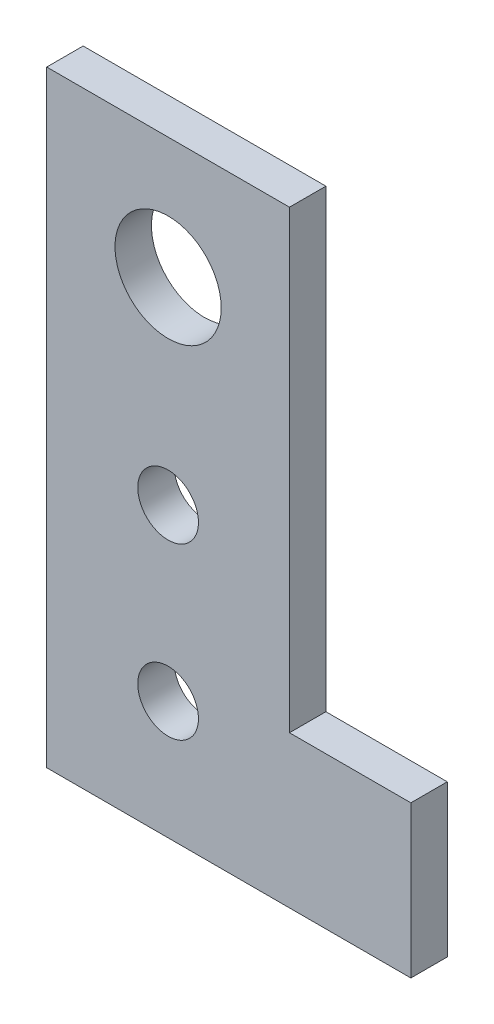
ISO-10303-21;
HEADER;
FILE_DESCRIPTION(('STEP AP214'),'2;1');
FILE_NAME('part.step','',(''),(''),'','','');
FILE_SCHEMA(('AUTOMOTIVE_DESIGN { 1 0 10303 214 1 1 1 1 }'));
ENDSEC;
DATA;
#1=APPLICATION_CONTEXT('core data for automotive mechanical design processes');
#2=APPLICATION_PROTOCOL_DEFINITION('international standard','automotive_design',2000,#1);
#3=PRODUCT_CONTEXT('',#1,'mechanical');
#4=PRODUCT('Part','Part','',(#3));
#5=PRODUCT_RELATED_PRODUCT_CATEGORY('part','',(#4));
#6=PRODUCT_DEFINITION_FORMATION('','',#4);
#7=PRODUCT_DEFINITION_CONTEXT('part definition',#1,'design');
#8=PRODUCT_DEFINITION('design','',#6,#7);
#9=PRODUCT_DEFINITION_SHAPE('','',#8);
#10=(LENGTH_UNIT() NAMED_UNIT(*) SI_UNIT(.MILLI.,.METRE.));
#11=(NAMED_UNIT(*) PLANE_ANGLE_UNIT() SI_UNIT($,.RADIAN.));
#12=(NAMED_UNIT(*) SI_UNIT($,.STERADIAN.) SOLID_ANGLE_UNIT());
#13=UNCERTAINTY_MEASURE_WITH_UNIT(LENGTH_MEASURE(1.E-05),#10,'distance_accuracy_value','');
#14=(GEOMETRIC_REPRESENTATION_CONTEXT(3) GLOBAL_UNCERTAINTY_ASSIGNED_CONTEXT((#13)) GLOBAL_UNIT_ASSIGNED_CONTEXT((#10,
#11,#12)) REPRESENTATION_CONTEXT('',''));
#15=CARTESIAN_POINT('',(0.,0.,0.));
#16=DIRECTION('',(0.,0.,1.));
#17=DIRECTION('',(1.,0.,0.));
#18=AXIS2_PLACEMENT_3D('',#15,#16,#17);
#19=CARTESIAN_POINT('',(0.,0.,-1.2));
#20=DIRECTION('',(-1.,0.,0.));
#21=DIRECTION('',(0.,-1.,0.));
#22=AXIS2_PLACEMENT_3D('',#19,#20,#21);
#23=PLANE('',#22);
#24=DIRECTION('',(0.,-1.,0.));
#25=VECTOR('',#24,1.);
#26=CARTESIAN_POINT('',(0.,0.,0.));
#27=LINE('',#26,#25);
#28=CARTESIAN_POINT('',(0.,20.,0.));
#29=VERTEX_POINT('',#28);
#30=CARTESIAN_POINT('',(0.,0.,0.));
#31=VERTEX_POINT('',#30);
#32=EDGE_CURVE('E123',#29,#31,#27,.T.);
#33=ORIENTED_EDGE('',*,*,#32,.F.);
#34=DIRECTION('',(0.,0.,1.));
#35=VECTOR('',#34,1.);
#36=CARTESIAN_POINT('',(0.,20.,-1.2));
#37=LINE('',#36,#35);
#38=CARTESIAN_POINT('',(0.,20.,-1.2));
#39=VERTEX_POINT('',#38);
#40=EDGE_CURVE('E11',#39,#29,#37,.T.);
#41=ORIENTED_EDGE('',*,*,#40,.F.);
#42=DIRECTION('',(0.,-1.,0.));
#43=VECTOR('',#42,1.);
#44=CARTESIAN_POINT('',(0.,0.,-1.2));
#45=LINE('',#44,#43);
#46=CARTESIAN_POINT('',(0.,0.,-1.2));
#47=VERTEX_POINT('',#46);
#48=EDGE_CURVE('E138',#39,#47,#45,.T.);
#49=ORIENTED_EDGE('',*,*,#48,.T.);
#50=DIRECTION('',(0.,0.,1.));
#51=VECTOR('',#50,1.);
#52=CARTESIAN_POINT('',(0.,0.,-1.2));
#53=LINE('',#52,#51);
#54=EDGE_CURVE('E41',#47,#31,#53,.T.);
#55=ORIENTED_EDGE('',*,*,#54,.T.);
#56=EDGE_LOOP('',(#33,#41,#49,#55));
#57=FACE_BOUND('',#56,.T.);
#58=ADVANCED_FACE('F38',(#57),#23,.T.);
#59=CARTESIAN_POINT('',(0.,20.,-1.2));
#60=DIRECTION('',(0.,1.,0.));
#61=DIRECTION('',(-1.,0.,0.));
#62=AXIS2_PLACEMENT_3D('',#59,#60,#61);
#63=PLANE('',#62);
#64=DIRECTION('',(-1.,0.,0.));
#65=VECTOR('',#64,1.);
#66=CARTESIAN_POINT('',(0.,20.,0.));
#67=LINE('',#66,#65);
#68=CARTESIAN_POINT('',(8.00000000000001,20.,0.));
#69=VERTEX_POINT('',#68);
#70=EDGE_CURVE('E136',#69,#29,#67,.T.);
#71=ORIENTED_EDGE('',*,*,#70,.F.);
#72=DIRECTION('',(0.,0.,1.));
#73=VECTOR('',#72,1.);
#74=CARTESIAN_POINT('',(8.00000000000001,20.,-1.2));
#75=LINE('',#74,#73);
#76=CARTESIAN_POINT('',(8.00000000000001,20.,-1.2));
#77=VERTEX_POINT('',#76);
#78=EDGE_CURVE('E47',#77,#69,#75,.T.);
#79=ORIENTED_EDGE('',*,*,#78,.F.);
#80=DIRECTION('',(-1.,0.,0.));
#81=VECTOR('',#80,1.);
#82=CARTESIAN_POINT('',(0.,20.,-1.2));
#83=LINE('',#82,#81);
#84=EDGE_CURVE('E113',#77,#39,#83,.T.);
#85=ORIENTED_EDGE('',*,*,#84,.T.);
#86=ORIENTED_EDGE('',*,*,#40,.T.);
#87=EDGE_LOOP('',(#71,#79,#85,#86));
#88=FACE_BOUND('',#87,.T.);
#89=ADVANCED_FACE('F146',(#88),#63,.T.);
#90=CARTESIAN_POINT('',(8.00000000000002,5.,-1.2));
#91=DIRECTION('',(1.,0.,0.));
#92=DIRECTION('',(0.,1.,0.));
#93=AXIS2_PLACEMENT_3D('',#90,#91,#92);
#94=PLANE('',#93);
#95=DIRECTION('',(0.,1.,0.));
#96=VECTOR('',#95,1.);
#97=CARTESIAN_POINT('',(8.00000000000002,5.,0.));
#98=LINE('',#97,#96);
#99=CARTESIAN_POINT('',(8.00000000000002,5.,0.));
#100=VERTEX_POINT('',#99);
#101=EDGE_CURVE('E100',#100,#69,#98,.T.);
#102=ORIENTED_EDGE('',*,*,#101,.F.);
#103=DIRECTION('',(0.,0.,1.));
#104=VECTOR('',#103,1.);
#105=CARTESIAN_POINT('',(8.00000000000002,5.,-1.2));
#106=LINE('',#105,#104);
#107=CARTESIAN_POINT('',(8.00000000000002,5.,-1.2));
#108=VERTEX_POINT('',#107);
#109=EDGE_CURVE('E95',#108,#100,#106,.T.);
#110=ORIENTED_EDGE('',*,*,#109,.F.);
#111=DIRECTION('',(0.,1.,0.));
#112=VECTOR('',#111,1.);
#113=CARTESIAN_POINT('',(8.00000000000002,5.,-1.2));
#114=LINE('',#113,#112);
#115=EDGE_CURVE('E98',#108,#77,#114,.T.);
#116=ORIENTED_EDGE('',*,*,#115,.T.);
#117=ORIENTED_EDGE('',*,*,#78,.T.);
#118=EDGE_LOOP('',(#102,#110,#116,#117));
#119=FACE_BOUND('',#118,.T.);
#120=ADVANCED_FACE('F97',(#119),#94,.T.);
#121=CARTESIAN_POINT('',(8.00000000000002,5.,-1.2));
#122=DIRECTION('',(0.,1.,0.));
#123=DIRECTION('',(0.,0.,1.));
#124=AXIS2_PLACEMENT_3D('',#121,#122,#123);
#125=PLANE('',#124);
#126=DIRECTION('',(-1.,0.,0.));
#127=VECTOR('',#126,1.);
#128=CARTESIAN_POINT('',(8.00000000000002,5.,0.));
#129=LINE('',#128,#127);
#130=CARTESIAN_POINT('',(12.,5.,0.));
#131=VERTEX_POINT('',#130);
#132=EDGE_CURVE('E133',#131,#100,#129,.T.);
#133=ORIENTED_EDGE('',*,*,#132,.F.);
#134=DIRECTION('',(0.,0.,1.));
#135=VECTOR('',#134,1.);
#136=CARTESIAN_POINT('',(12.,5.,-1.2));
#137=LINE('',#136,#135);
#138=CARTESIAN_POINT('',(12.,5.,-1.2));
#139=VERTEX_POINT('',#138);
#140=EDGE_CURVE('E105',#139,#131,#137,.T.);
#141=ORIENTED_EDGE('',*,*,#140,.F.);
#142=DIRECTION('',(-1.,0.,0.));
#143=VECTOR('',#142,1.);
#144=CARTESIAN_POINT('',(8.00000000000002,5.,-1.2));
#145=LINE('',#144,#143);
#146=EDGE_CURVE('E111',#139,#108,#145,.T.);
#147=ORIENTED_EDGE('',*,*,#146,.T.);
#148=ORIENTED_EDGE('',*,*,#109,.T.);
#149=EDGE_LOOP('',(#133,#141,#147,#148));
#150=FACE_BOUND('',#149,.T.);
#151=ADVANCED_FACE('F115',(#150),#125,.T.);
#152=CARTESIAN_POINT('',(12.,0.,-1.2));
#153=DIRECTION('',(1.,0.,0.));
#154=DIRECTION('',(0.,0.,-1.));
#155=AXIS2_PLACEMENT_3D('',#152,#153,#154);
#156=PLANE('',#155);
#157=DIRECTION('',(0.,1.,0.));
#158=VECTOR('',#157,1.);
#159=CARTESIAN_POINT('',(12.,0.,0.));
#160=LINE('',#159,#158);
#161=CARTESIAN_POINT('',(12.,0.,0.));
#162=VERTEX_POINT('',#161);
#163=EDGE_CURVE('E130',#162,#131,#160,.T.);
#164=ORIENTED_EDGE('',*,*,#163,.F.);
#165=DIRECTION('',(0.,0.,1.));
#166=VECTOR('',#165,1.);
#167=CARTESIAN_POINT('',(12.,0.,-1.2));
#168=LINE('',#167,#166);
#169=CARTESIAN_POINT('',(12.,0.,-1.2));
#170=VERTEX_POINT('',#169);
#171=EDGE_CURVE('E141',#170,#162,#168,.T.);
#172=ORIENTED_EDGE('',*,*,#171,.F.);
#173=DIRECTION('',(0.,1.,0.));
#174=VECTOR('',#173,1.);
#175=CARTESIAN_POINT('',(12.,0.,-1.2));
#176=LINE('',#175,#174);
#177=EDGE_CURVE('E116',#170,#139,#176,.T.);
#178=ORIENTED_EDGE('',*,*,#177,.T.);
#179=ORIENTED_EDGE('',*,*,#140,.T.);
#180=EDGE_LOOP('',(#164,#172,#178,#179));
#181=FACE_BOUND('',#180,.T.);
#182=ADVANCED_FACE('F159',(#181),#156,.T.);
#183=CARTESIAN_POINT('',(0.,0.,-1.2));
#184=DIRECTION('',(0.,-1.,0.));
#185=DIRECTION('',(0.,0.,-1.));
#186=AXIS2_PLACEMENT_3D('',#183,#184,#185);
#187=PLANE('',#186);
#188=DIRECTION('',(1.,0.,0.));
#189=VECTOR('',#188,1.);
#190=CARTESIAN_POINT('',(0.,0.,0.));
#191=LINE('',#190,#189);
#192=EDGE_CURVE('E126',#31,#162,#191,.T.);
#193=ORIENTED_EDGE('',*,*,#192,.F.);
#194=ORIENTED_EDGE('',*,*,#54,.F.);
#195=DIRECTION('',(1.,0.,0.));
#196=VECTOR('',#195,1.);
#197=CARTESIAN_POINT('',(0.,0.,-1.2));
#198=LINE('',#197,#196);
#199=EDGE_CURVE('E118',#47,#170,#198,.T.);
#200=ORIENTED_EDGE('',*,*,#199,.T.);
#201=ORIENTED_EDGE('',*,*,#171,.T.);
#202=EDGE_LOOP('',(#193,#194,#200,#201));
#203=FACE_BOUND('',#202,.T.);
#204=ADVANCED_FACE('F143',(#203),#187,.T.);
#205=CARTESIAN_POINT('',(0.,0.,-1.2));
#206=DIRECTION('',(0.,0.,-1.));
#207=DIRECTION('',(-1.,0.,0.));
#208=AXIS2_PLACEMENT_3D('',#205,#206,#207);
#209=PLANE('',#208);
#210=CARTESIAN_POINT('',(4.00000000000001,3.9,-1.2));
#211=DIRECTION('',(0.,0.,1.));
#212=DIRECTION('',(1.,0.,0.));
#213=AXIS2_PLACEMENT_3D('',#210,#211,#212);
#214=CIRCLE('',#213,1.);
#215=CARTESIAN_POINT('',(5.00000000000001,3.9,-1.2));
#216=VERTEX_POINT('',#215);
#217=EDGE_CURVE('E189',#216,#216,#214,.T.);
#218=ORIENTED_EDGE('',*,*,#217,.T.);
#219=EDGE_LOOP('',(#218));
#220=FACE_BOUND('',#219,.T.);
#221=CARTESIAN_POINT('',(4.00000000000001,9.5,-1.2));
#222=DIRECTION('',(0.,0.,1.));
#223=DIRECTION('',(1.,0.,0.));
#224=AXIS2_PLACEMENT_3D('',#221,#222,#223);
#225=CIRCLE('',#224,1.);
#226=CARTESIAN_POINT('',(5.00000000000001,9.5,-1.2));
#227=VERTEX_POINT('',#226);
#228=EDGE_CURVE('E197',#227,#227,#225,.T.);
#229=ORIENTED_EDGE('',*,*,#228,.T.);
#230=EDGE_LOOP('',(#229));
#231=FACE_BOUND('',#230,.T.);
#232=CARTESIAN_POINT('',(4.00000000000001,16.,-1.2));
#233=DIRECTION('',(0.,0.,1.));
#234=DIRECTION('',(1.,0.,0.));
#235=AXIS2_PLACEMENT_3D('',#232,#233,#234);
#236=CIRCLE('',#235,1.75);
#237=CARTESIAN_POINT('',(5.75000000000001,16.,-1.2));
#238=VERTEX_POINT('',#237);
#239=EDGE_CURVE('E127',#238,#238,#236,.T.);
#240=ORIENTED_EDGE('',*,*,#239,.T.);
#241=EDGE_LOOP('',(#240));
#242=FACE_BOUND('',#241,.T.);
#243=ORIENTED_EDGE('',*,*,#48,.F.);
#244=ORIENTED_EDGE('',*,*,#84,.F.);
#245=ORIENTED_EDGE('',*,*,#115,.F.);
#246=ORIENTED_EDGE('',*,*,#146,.F.);
#247=ORIENTED_EDGE('',*,*,#177,.F.);
#248=ORIENTED_EDGE('',*,*,#199,.F.);
#249=EDGE_LOOP('',(#243,#244,#245,#246,#247,#248));
#250=FACE_BOUND('',#249,.T.);
#251=ADVANCED_FACE('F109',(#220,#231,#242,#250),#209,.T.);
#252=CARTESIAN_POINT('',(0.,0.,0.));
#253=DIRECTION('',(0.,0.,-1.));
#254=DIRECTION('',(-1.,0.,0.));
#255=AXIS2_PLACEMENT_3D('',#252,#253,#254);
#256=PLANE('',#255);
#257=CARTESIAN_POINT('',(4.00000000000001,3.9,0.));
#258=DIRECTION('',(0.,0.,1.));
#259=DIRECTION('',(1.,0.,0.));
#260=AXIS2_PLACEMENT_3D('',#257,#258,#259);
#261=CIRCLE('',#260,1.);
#262=CARTESIAN_POINT('',(5.00000000000001,3.9,0.));
#263=VERTEX_POINT('',#262);
#264=EDGE_CURVE('E192',#263,#263,#261,.T.);
#265=ORIENTED_EDGE('',*,*,#264,.F.);
#266=EDGE_LOOP('',(#265));
#267=FACE_BOUND('',#266,.T.);
#268=CARTESIAN_POINT('',(4.00000000000001,9.5,0.));
#269=DIRECTION('',(0.,0.,1.));
#270=DIRECTION('',(1.,0.,0.));
#271=AXIS2_PLACEMENT_3D('',#268,#269,#270);
#272=CIRCLE('',#271,1.);
#273=CARTESIAN_POINT('',(5.00000000000001,9.5,0.));
#274=VERTEX_POINT('',#273);
#275=EDGE_CURVE('E194',#274,#274,#272,.T.);
#276=ORIENTED_EDGE('',*,*,#275,.F.);
#277=EDGE_LOOP('',(#276));
#278=FACE_BOUND('',#277,.T.);
#279=CARTESIAN_POINT('',(4.00000000000001,16.,0.));
#280=DIRECTION('',(0.,0.,1.));
#281=DIRECTION('',(1.,0.,0.));
#282=AXIS2_PLACEMENT_3D('',#279,#280,#281);
#283=CIRCLE('',#282,1.75);
#284=CARTESIAN_POINT('',(5.75000000000001,16.,0.));
#285=VERTEX_POINT('',#284);
#286=EDGE_CURVE('E200',#285,#285,#283,.T.);
#287=ORIENTED_EDGE('',*,*,#286,.F.);
#288=EDGE_LOOP('',(#287));
#289=FACE_BOUND('',#288,.T.);
#290=ORIENTED_EDGE('',*,*,#32,.T.);
#291=ORIENTED_EDGE('',*,*,#192,.T.);
#292=ORIENTED_EDGE('',*,*,#163,.T.);
#293=ORIENTED_EDGE('',*,*,#132,.T.);
#294=ORIENTED_EDGE('',*,*,#101,.T.);
#295=ORIENTED_EDGE('',*,*,#70,.T.);
#296=EDGE_LOOP('',(#290,#291,#292,#293,#294,#295));
#297=FACE_BOUND('',#296,.T.);
#298=ADVANCED_FACE('F145',(#267,#278,#289,#297),#256,.F.);
#299=CARTESIAN_POINT('',(4.00000000000001,16.,-1.2));
#300=DIRECTION('',(0.,0.,1.));
#301=DIRECTION('',(1.,0.,0.));
#302=AXIS2_PLACEMENT_3D('',#299,#300,#301);
#303=CYLINDRICAL_SURFACE('',#302,1.75);
#304=ORIENTED_EDGE('',*,*,#239,.F.);
#305=EDGE_LOOP('',(#304));
#306=FACE_BOUND('',#305,.T.);
#307=ORIENTED_EDGE('',*,*,#286,.T.);
#308=EDGE_LOOP('',(#307));
#309=FACE_BOUND('',#308,.T.);
#310=ADVANCED_FACE('F170',(#306,#309),#303,.F.);
#311=CARTESIAN_POINT('',(4.00000000000001,9.5,-1.2));
#312=DIRECTION('',(0.,0.,1.));
#313=DIRECTION('',(1.,0.,0.));
#314=AXIS2_PLACEMENT_3D('',#311,#312,#313);
#315=CYLINDRICAL_SURFACE('',#314,1.);
#316=ORIENTED_EDGE('',*,*,#228,.F.);
#317=EDGE_LOOP('',(#316));
#318=FACE_BOUND('',#317,.T.);
#319=ORIENTED_EDGE('',*,*,#275,.T.);
#320=EDGE_LOOP('',(#319));
#321=FACE_BOUND('',#320,.T.);
#322=ADVANCED_FACE('F177',(#318,#321),#315,.F.);
#323=CARTESIAN_POINT('',(4.00000000000001,3.9,-1.2));
#324=DIRECTION('',(0.,0.,1.));
#325=DIRECTION('',(1.,0.,0.));
#326=AXIS2_PLACEMENT_3D('',#323,#324,#325);
#327=CYLINDRICAL_SURFACE('',#326,1.);
#328=ORIENTED_EDGE('',*,*,#217,.F.);
#329=EDGE_LOOP('',(#328));
#330=FACE_BOUND('',#329,.T.);
#331=ORIENTED_EDGE('',*,*,#264,.T.);
#332=EDGE_LOOP('',(#331));
#333=FACE_BOUND('',#332,.T.);
#334=ADVANCED_FACE('F181',(#330,#333),#327,.F.);
#335=CLOSED_SHELL('',(#58,#89,#120,#151,#182,#204,#251,#298,#310,#322,#334));
#336=MANIFOLD_SOLID_BREP('B2',#335);
#337=ADVANCED_BREP_SHAPE_REPRESENTATION('',(#18,#336),#14);
#338=SHAPE_DEFINITION_REPRESENTATION(#9,#337);
ENDSEC;
END-ISO-10303-21;
